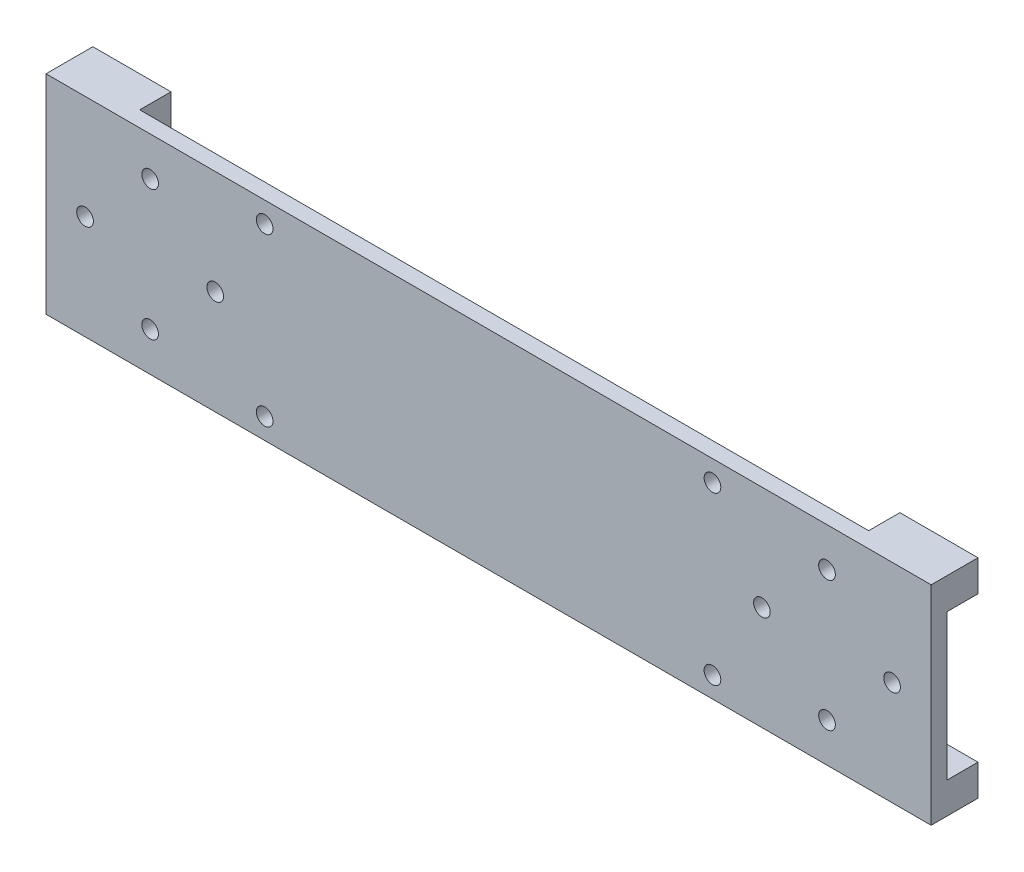
ISO-10303-21;
HEADER;
FILE_DESCRIPTION(('STEP AP214'),'2;1');
FILE_NAME('part.step','',(''),(''),'','','');
FILE_SCHEMA(('AUTOMOTIVE_DESIGN { 1 0 10303 214 1 1 1 1 }'));
ENDSEC;
DATA;
#1=APPLICATION_CONTEXT('core data for automotive mechanical design processes');
#2=APPLICATION_PROTOCOL_DEFINITION('international standard','automotive_design',2000,#1);
#3=PRODUCT_CONTEXT('',#1,'mechanical');
#4=PRODUCT('Part','Part','',(#3));
#5=PRODUCT_RELATED_PRODUCT_CATEGORY('part','',(#4));
#6=PRODUCT_DEFINITION_FORMATION('','',#4);
#7=PRODUCT_DEFINITION_CONTEXT('part definition',#1,'design');
#8=PRODUCT_DEFINITION('design','',#6,#7);
#9=PRODUCT_DEFINITION_SHAPE('','',#8);
#10=(LENGTH_UNIT() NAMED_UNIT(*) SI_UNIT(.MILLI.,.METRE.));
#11=(NAMED_UNIT(*) PLANE_ANGLE_UNIT() SI_UNIT($,.RADIAN.));
#12=(NAMED_UNIT(*) SI_UNIT($,.STERADIAN.) SOLID_ANGLE_UNIT());
#13=UNCERTAINTY_MEASURE_WITH_UNIT(LENGTH_MEASURE(1.E-05),#10,'distance_accuracy_value','');
#14=(GEOMETRIC_REPRESENTATION_CONTEXT(3) GLOBAL_UNCERTAINTY_ASSIGNED_CONTEXT((#13)) GLOBAL_UNIT_ASSIGNED_CONTEXT((#10,
#11,#12)) REPRESENTATION_CONTEXT('',''));
#15=CARTESIAN_POINT('',(0.,0.,0.));
#16=DIRECTION('',(0.,0.,1.));
#17=DIRECTION('',(1.,0.,0.));
#18=AXIS2_PLACEMENT_3D('',#15,#16,#17);
#19=CARTESIAN_POINT('',(0.,0.,0.));
#20=DIRECTION('',(0.,0.,1.));
#21=DIRECTION('',(1.,0.,0.));
#22=AXIS2_PLACEMENT_3D('',#19,#20,#21);
#23=PLANE('',#22);
#24=CARTESIAN_POINT('',(36.4960422163588,-19.9709762532981,0.));
#25=DIRECTION('',(0.,0.,-1.));
#26=DIRECTION('',(-1.,0.,0.));
#27=AXIS2_PLACEMENT_3D('',#24,#25,#26);
#28=CIRCLE('',#27,1.6);
#29=CARTESIAN_POINT('',(34.8960422163588,-19.9709762532981,0.));
#30=VERTEX_POINT('',#29);
#31=EDGE_CURVE('E303',#30,#30,#28,.T.);
#32=ORIENTED_EDGE('',*,*,#31,.F.);
#33=EDGE_LOOP('',(#32));
#34=FACE_BOUND('',#33,.T.);
#35=CARTESIAN_POINT('',(-49.5039577836412,12.0290237467019,0.));
#36=DIRECTION('',(0.,0.,-1.));
#37=DIRECTION('',(-1.,0.,0.));
#38=AXIS2_PLACEMENT_3D('',#35,#36,#37);
#39=CIRCLE('',#38,1.6);
#40=CARTESIAN_POINT('',(-51.1039577836411,12.0290237467019,0.));
#41=VERTEX_POINT('',#40);
#42=EDGE_CURVE('E312',#41,#41,#39,.T.);
#43=ORIENTED_EDGE('',*,*,#42,.F.);
#44=EDGE_LOOP('',(#43));
#45=FACE_BOUND('',#44,.T.);
#46=CARTESIAN_POINT('',(-49.5039577836412,-19.9709762532981,0.));
#47=DIRECTION('',(0.,0.,-1.));
#48=DIRECTION('',(-1.,0.,0.));
#49=AXIS2_PLACEMENT_3D('',#46,#47,#48);
#50=CIRCLE('',#49,1.6);
#51=CARTESIAN_POINT('',(-51.1039577836411,-19.9709762532981,0.));
#52=VERTEX_POINT('',#51);
#53=EDGE_CURVE('E295',#52,#52,#50,.T.);
#54=ORIENTED_EDGE('',*,*,#53,.F.);
#55=EDGE_LOOP('',(#54));
#56=FACE_BOUND('',#55,.T.);
#57=CARTESIAN_POINT('',(36.4960422163588,12.0290237467019,0.));
#58=DIRECTION('',(0.,0.,-1.));
#59=DIRECTION('',(-1.,0.,0.));
#60=AXIS2_PLACEMENT_3D('',#57,#58,#59);
#61=CIRCLE('',#60,1.6);
#62=CARTESIAN_POINT('',(34.8960422163588,12.0290237467019,0.));
#63=VERTEX_POINT('',#62);
#64=EDGE_CURVE('E307',#63,#63,#61,.T.);
#65=ORIENTED_EDGE('',*,*,#64,.F.);
#66=EDGE_LOOP('',(#65));
#67=FACE_BOUND('',#66,.T.);
#68=CARTESIAN_POINT('',(-71.5039577836412,8.52902374670185,0.));
#69=DIRECTION('',(0.,0.,1.));
#70=DIRECTION('',(1.,0.,0.));
#71=AXIS2_PLACEMENT_3D('',#68,#69,#70);
#72=CIRCLE('',#71,1.6);
#73=CARTESIAN_POINT('',(-69.9039577836412,8.52902374670185,0.));
#74=VERTEX_POINT('',#73);
#75=EDGE_CURVE('E379',#74,#74,#72,.T.);
#76=ORIENTED_EDGE('',*,*,#75,.T.);
#77=EDGE_LOOP('',(#76));
#78=FACE_BOUND('',#77,.T.);
#79=CARTESIAN_POINT('',(-59.0039577836412,-3.97097625329815,0.));
#80=DIRECTION('',(0.,0.,1.));
#81=DIRECTION('',(1.,0.,0.));
#82=AXIS2_PLACEMENT_3D('',#79,#80,#81);
#83=CIRCLE('',#82,1.6);
#84=CARTESIAN_POINT('',(-57.4039577836412,-3.97097625329815,0.));
#85=VERTEX_POINT('',#84);
#86=EDGE_CURVE('E371',#85,#85,#83,.T.);
#87=ORIENTED_EDGE('',*,*,#86,.T.);
#88=EDGE_LOOP('',(#87));
#89=FACE_BOUND('',#88,.T.);
#90=CARTESIAN_POINT('',(-71.5039577836412,-16.4709762532982,0.));
#91=DIRECTION('',(0.,0.,1.));
#92=DIRECTION('',(1.,0.,0.));
#93=AXIS2_PLACEMENT_3D('',#90,#91,#92);
#94=CIRCLE('',#93,1.6);
#95=CARTESIAN_POINT('',(-69.9039577836412,-16.4709762532982,0.));
#96=VERTEX_POINT('',#95);
#97=EDGE_CURVE('E363',#96,#96,#94,.T.);
#98=ORIENTED_EDGE('',*,*,#97,.T.);
#99=EDGE_LOOP('',(#98));
#100=FACE_BOUND('',#99,.T.);
#101=CARTESIAN_POINT('',(-84.0039577836412,-3.97097625329815,0.));
#102=DIRECTION('',(0.,0.,1.));
#103=DIRECTION('',(1.,0.,0.));
#104=AXIS2_PLACEMENT_3D('',#101,#102,#103);
#105=CIRCLE('',#104,1.60000000000001);
#106=CARTESIAN_POINT('',(-82.4039577836411,-3.97097625329815,0.));
#107=VERTEX_POINT('',#106);
#108=EDGE_CURVE('E355',#107,#107,#105,.T.);
#109=ORIENTED_EDGE('',*,*,#108,.T.);
#110=EDGE_LOOP('',(#109));
#111=FACE_BOUND('',#110,.T.);
#112=CARTESIAN_POINT('',(70.9960422163588,-3.97097625329815,0.));
#113=DIRECTION('',(0.,0.,1.));
#114=DIRECTION('',(-1.,0.,0.));
#115=AXIS2_PLACEMENT_3D('',#112,#113,#114);
#116=CIRCLE('',#115,1.60000000000001);
#117=CARTESIAN_POINT('',(69.3960422163588,-3.97097625329815,0.));
#118=VERTEX_POINT('',#117);
#119=EDGE_CURVE('E347',#118,#118,#116,.T.);
#120=ORIENTED_EDGE('',*,*,#119,.T.);
#121=EDGE_LOOP('',(#120));
#122=FACE_BOUND('',#121,.T.);
#123=CARTESIAN_POINT('',(58.4960422163588,8.52902374670185,0.));
#124=DIRECTION('',(0.,0.,1.));
#125=DIRECTION('',(-1.,0.,0.));
#126=AXIS2_PLACEMENT_3D('',#123,#124,#125);
#127=CIRCLE('',#126,1.6);
#128=CARTESIAN_POINT('',(56.8960422163588,8.52902374670185,0.));
#129=VERTEX_POINT('',#128);
#130=EDGE_CURVE('E339',#129,#129,#127,.T.);
#131=ORIENTED_EDGE('',*,*,#130,.T.);
#132=EDGE_LOOP('',(#131));
#133=FACE_BOUND('',#132,.T.);
#134=CARTESIAN_POINT('',(58.4960422163588,-16.4709762532982,0.));
#135=DIRECTION('',(0.,0.,1.));
#136=DIRECTION('',(-1.,0.,0.));
#137=AXIS2_PLACEMENT_3D('',#134,#135,#136);
#138=CIRCLE('',#137,1.6);
#139=CARTESIAN_POINT('',(56.8960422163588,-16.4709762532982,0.));
#140=VERTEX_POINT('',#139);
#141=EDGE_CURVE('E331',#140,#140,#138,.T.);
#142=ORIENTED_EDGE('',*,*,#141,.T.);
#143=EDGE_LOOP('',(#142));
#144=FACE_BOUND('',#143,.T.);
#145=CARTESIAN_POINT('',(45.9960422163588,-3.97097625329815,0.));
#146=DIRECTION('',(0.,0.,1.));
#147=DIRECTION('',(-1.,0.,0.));
#148=AXIS2_PLACEMENT_3D('',#145,#146,#147);
#149=CIRCLE('',#148,1.6);
#150=CARTESIAN_POINT('',(44.3960422163588,-3.97097625329815,0.));
#151=VERTEX_POINT('',#150);
#152=EDGE_CURVE('E323',#151,#151,#149,.T.);
#153=ORIENTED_EDGE('',*,*,#152,.T.);
#154=EDGE_LOOP('',(#153));
#155=FACE_BOUND('',#154,.T.);
#156=DIRECTION('',(1.,0.,0.));
#157=VECTOR('',#156,1.);
#158=CARTESIAN_POINT('',(78.4960422163588,-17.9709762532982,0.));
#159=LINE('',#158,#157);
#160=CARTESIAN_POINT('',(63.4960422163589,-17.9709762532982,0.));
#161=VERTEX_POINT('',#160);
#162=CARTESIAN_POINT('',(78.4960422163588,-17.9709762532982,0.));
#163=VERTEX_POINT('',#162);
#164=EDGE_CURVE('E211',#161,#163,#159,.T.);
#165=ORIENTED_EDGE('',*,*,#164,.F.);
#166=DIRECTION('',(0.,1.,0.));
#167=VECTOR('',#166,1.);
#168=CARTESIAN_POINT('',(63.4960422163589,-23.9709762532982,0.));
#169=LINE('',#168,#167);
#170=CARTESIAN_POINT('',(63.4960422163589,-23.9709762532982,0.));
#171=VERTEX_POINT('',#170);
#172=EDGE_CURVE('E61',#171,#161,#169,.T.);
#173=ORIENTED_EDGE('',*,*,#172,.F.);
#174=DIRECTION('',(1.,0.,0.));
#175=VECTOR('',#174,1.);
#176=CARTESIAN_POINT('',(-91.5039577836412,-23.9709762532982,0.));
#177=LINE('',#176,#175);
#178=CARTESIAN_POINT('',(-76.5039577836412,-23.9709762532982,0.));
#179=VERTEX_POINT('',#178);
#180=EDGE_CURVE('E65',#179,#171,#177,.T.);
#181=ORIENTED_EDGE('',*,*,#180,.F.);
#182=DIRECTION('',(0.,-1.,0.));
#183=VECTOR('',#182,1.);
#184=CARTESIAN_POINT('',(-76.5039577836412,-23.9709762532981,0.));
#185=LINE('',#184,#183);
#186=CARTESIAN_POINT('',(-76.5039577836412,-17.9709762532981,0.));
#187=VERTEX_POINT('',#186);
#188=EDGE_CURVE('E153',#187,#179,#185,.T.);
#189=ORIENTED_EDGE('',*,*,#188,.F.);
#190=DIRECTION('',(1.,0.,0.));
#191=VECTOR('',#190,1.);
#192=CARTESIAN_POINT('',(-91.5039577836412,-17.9709762532981,0.));
#193=LINE('',#192,#191);
#194=CARTESIAN_POINT('',(-91.5039577836412,-17.9709762532981,0.));
#195=VERTEX_POINT('',#194);
#196=EDGE_CURVE('E155',#195,#187,#193,.T.);
#197=ORIENTED_EDGE('',*,*,#196,.F.);
#198=DIRECTION('',(0.,-1.,0.));
#199=VECTOR('',#198,1.);
#200=CARTESIAN_POINT('',(-91.5039577836412,16.0290237467018,0.));
#201=LINE('',#200,#199);
#202=CARTESIAN_POINT('',(-91.5039577836412,10.0290237467019,0.));
#203=VERTEX_POINT('',#202);
#204=EDGE_CURVE('E387',#203,#195,#201,.T.);
#205=ORIENTED_EDGE('',*,*,#204,.F.);
#206=DIRECTION('',(-1.,0.,0.));
#207=VECTOR('',#206,1.);
#208=CARTESIAN_POINT('',(-91.5039577836412,10.0290237467019,0.));
#209=LINE('',#208,#207);
#210=CARTESIAN_POINT('',(-76.5039577836412,10.0290237467019,0.));
#211=VERTEX_POINT('',#210);
#212=EDGE_CURVE('E242',#211,#203,#209,.T.);
#213=ORIENTED_EDGE('',*,*,#212,.F.);
#214=DIRECTION('',(0.,-1.,0.));
#215=VECTOR('',#214,1.);
#216=CARTESIAN_POINT('',(-76.5039577836412,16.0290237467019,0.));
#217=LINE('',#216,#215);
#218=CARTESIAN_POINT('',(-76.5039577836412,16.0290237467018,0.));
#219=VERTEX_POINT('',#218);
#220=EDGE_CURVE('E202',#219,#211,#217,.T.);
#221=ORIENTED_EDGE('',*,*,#220,.F.);
#222=DIRECTION('',(-1.,0.,0.));
#223=VECTOR('',#222,1.);
#224=CARTESIAN_POINT('',(-91.5039577836412,16.0290237467018,0.));
#225=LINE('',#224,#223);
#226=CARTESIAN_POINT('',(63.4960422163589,16.0290237467018,0.));
#227=VERTEX_POINT('',#226);
#228=EDGE_CURVE('E396',#227,#219,#225,.T.);
#229=ORIENTED_EDGE('',*,*,#228,.F.);
#230=DIRECTION('',(0.,1.,0.));
#231=VECTOR('',#230,1.);
#232=CARTESIAN_POINT('',(63.4960422163589,16.0290237467018,0.));
#233=LINE('',#232,#231);
#234=CARTESIAN_POINT('',(63.4960422163589,10.0290237467018,0.));
#235=VERTEX_POINT('',#234);
#236=EDGE_CURVE('E266',#235,#227,#233,.T.);
#237=ORIENTED_EDGE('',*,*,#236,.F.);
#238=DIRECTION('',(-1.,0.,0.));
#239=VECTOR('',#238,1.);
#240=CARTESIAN_POINT('',(78.4960422163588,10.0290237467018,0.));
#241=LINE('',#240,#239);
#242=CARTESIAN_POINT('',(78.4960422163588,10.0290237467018,0.));
#243=VERTEX_POINT('',#242);
#244=EDGE_CURVE('E218',#243,#235,#241,.T.);
#245=ORIENTED_EDGE('',*,*,#244,.F.);
#246=DIRECTION('',(0.,1.,0.));
#247=VECTOR('',#246,1.);
#248=CARTESIAN_POINT('',(78.4960422163588,16.0290237467018,0.));
#249=LINE('',#248,#247);
#250=EDGE_CURVE('E410',#163,#243,#249,.T.);
#251=ORIENTED_EDGE('',*,*,#250,.F.);
#252=EDGE_LOOP('',(#165,#173,#181,#189,#197,#205,#213,#221,#229,#237,#245,#251));
#253=FACE_BOUND('',#252,.T.);
#254=ADVANCED_FACE('F45',(#34,#45,#56,#67,#78,#89,#100,#111,#122,#133,#144,#155,#253),#23,.F.);
#255=CARTESIAN_POINT('',(0.,0.,3.));
#256=DIRECTION('',(0.,0.,1.));
#257=DIRECTION('',(1.,0.,0.));
#258=AXIS2_PLACEMENT_3D('',#255,#256,#257);
#259=PLANE('',#258);
#260=CARTESIAN_POINT('',(36.4960422163588,-19.9709762532981,3.));
#261=DIRECTION('',(0.,0.,-1.));
#262=DIRECTION('',(-1.,0.,0.));
#263=AXIS2_PLACEMENT_3D('',#260,#261,#262);
#264=CIRCLE('',#263,1.6);
#265=CARTESIAN_POINT('',(34.8960422163588,-19.9709762532981,3.));
#266=VERTEX_POINT('',#265);
#267=EDGE_CURVE('E308',#266,#266,#264,.T.);
#268=ORIENTED_EDGE('',*,*,#267,.T.);
#269=EDGE_LOOP('',(#268));
#270=FACE_BOUND('',#269,.T.);
#271=CARTESIAN_POINT('',(-49.5039577836412,12.0290237467019,3.));
#272=DIRECTION('',(0.,0.,-1.));
#273=DIRECTION('',(-1.,0.,0.));
#274=AXIS2_PLACEMENT_3D('',#271,#272,#273);
#275=CIRCLE('',#274,1.6);
#276=CARTESIAN_POINT('',(-51.1039577836411,12.0290237467019,3.));
#277=VERTEX_POINT('',#276);
#278=EDGE_CURVE('E299',#277,#277,#275,.T.);
#279=ORIENTED_EDGE('',*,*,#278,.T.);
#280=EDGE_LOOP('',(#279));
#281=FACE_BOUND('',#280,.T.);
#282=CARTESIAN_POINT('',(-49.5039577836412,-19.9709762532981,3.));
#283=DIRECTION('',(0.,0.,-1.));
#284=DIRECTION('',(-1.,0.,0.));
#285=AXIS2_PLACEMENT_3D('',#282,#283,#284);
#286=CIRCLE('',#285,1.6);
#287=CARTESIAN_POINT('',(-51.1039577836411,-19.9709762532981,3.));
#288=VERTEX_POINT('',#287);
#289=EDGE_CURVE('E294',#288,#288,#286,.T.);
#290=ORIENTED_EDGE('',*,*,#289,.T.);
#291=EDGE_LOOP('',(#290));
#292=FACE_BOUND('',#291,.T.);
#293=CARTESIAN_POINT('',(36.4960422163588,12.0290237467019,3.));
#294=DIRECTION('',(0.,0.,-1.));
#295=DIRECTION('',(-1.,0.,0.));
#296=AXIS2_PLACEMENT_3D('',#293,#294,#295);
#297=CIRCLE('',#296,1.6);
#298=CARTESIAN_POINT('',(34.8960422163588,12.0290237467019,3.));
#299=VERTEX_POINT('',#298);
#300=EDGE_CURVE('E319',#299,#299,#297,.T.);
#301=ORIENTED_EDGE('',*,*,#300,.T.);
#302=EDGE_LOOP('',(#301));
#303=FACE_BOUND('',#302,.T.);
#304=CARTESIAN_POINT('',(58.4960422163588,-16.4709762532982,3.));
#305=DIRECTION('',(0.,0.,1.));
#306=DIRECTION('',(-1.,0.,0.));
#307=AXIS2_PLACEMENT_3D('',#304,#305,#306);
#308=CIRCLE('',#307,1.6);
#309=CARTESIAN_POINT('',(56.8960422163588,-16.4709762532982,3.));
#310=VERTEX_POINT('',#309);
#311=EDGE_CURVE('E335',#310,#310,#308,.T.);
#312=ORIENTED_EDGE('',*,*,#311,.F.);
#313=EDGE_LOOP('',(#312));
#314=FACE_BOUND('',#313,.T.);
#315=CARTESIAN_POINT('',(70.9960422163588,-3.97097625329815,3.));
#316=DIRECTION('',(0.,0.,1.));
#317=DIRECTION('',(-1.,0.,0.));
#318=AXIS2_PLACEMENT_3D('',#315,#316,#317);
#319=CIRCLE('',#318,1.60000000000001);
#320=CARTESIAN_POINT('',(69.3960422163588,-3.97097625329815,3.));
#321=VERTEX_POINT('',#320);
#322=EDGE_CURVE('E351',#321,#321,#319,.T.);
#323=ORIENTED_EDGE('',*,*,#322,.F.);
#324=EDGE_LOOP('',(#323));
#325=FACE_BOUND('',#324,.T.);
#326=CARTESIAN_POINT('',(-71.5039577836412,-16.4709762532982,3.));
#327=DIRECTION('',(0.,0.,1.));
#328=DIRECTION('',(1.,0.,0.));
#329=AXIS2_PLACEMENT_3D('',#326,#327,#328);
#330=CIRCLE('',#329,1.6);
#331=CARTESIAN_POINT('',(-69.9039577836412,-16.4709762532982,3.));
#332=VERTEX_POINT('',#331);
#333=EDGE_CURVE('E367',#332,#332,#330,.T.);
#334=ORIENTED_EDGE('',*,*,#333,.F.);
#335=EDGE_LOOP('',(#334));
#336=FACE_BOUND('',#335,.T.);
#337=CARTESIAN_POINT('',(-71.5039577836412,8.52902374670185,3.));
#338=DIRECTION('',(0.,0.,1.));
#339=DIRECTION('',(1.,0.,0.));
#340=AXIS2_PLACEMENT_3D('',#337,#338,#339);
#341=CIRCLE('',#340,1.6);
#342=CARTESIAN_POINT('',(-69.9039577836412,8.52902374670185,3.));
#343=VERTEX_POINT('',#342);
#344=EDGE_CURVE('E383',#343,#343,#341,.T.);
#345=ORIENTED_EDGE('',*,*,#344,.F.);
#346=EDGE_LOOP('',(#345));
#347=FACE_BOUND('',#346,.T.);
#348=DIRECTION('',(0.,-1.,0.));
#349=VECTOR('',#348,1.);
#350=CARTESIAN_POINT('',(-91.5039577836412,16.0290237467018,3.));
#351=LINE('',#350,#349);
#352=CARTESIAN_POINT('',(-91.5039577836412,16.0290237467018,3.));
#353=VERTEX_POINT('',#352);
#354=CARTESIAN_POINT('',(-91.5039577836412,-23.9709762532982,3.));
#355=VERTEX_POINT('',#354);
#356=EDGE_CURVE('E391',#353,#355,#351,.T.);
#357=ORIENTED_EDGE('',*,*,#356,.T.);
#358=DIRECTION('',(1.,0.,0.));
#359=VECTOR('',#358,1.);
#360=CARTESIAN_POINT('',(-91.5039577836412,-23.9709762532982,3.));
#361=LINE('',#360,#359);
#362=CARTESIAN_POINT('',(78.4960422163588,-23.9709762532982,3.));
#363=VERTEX_POINT('',#362);
#364=EDGE_CURVE('E395',#355,#363,#361,.T.);
#365=ORIENTED_EDGE('',*,*,#364,.T.);
#366=DIRECTION('',(0.,1.,0.));
#367=VECTOR('',#366,1.);
#368=CARTESIAN_POINT('',(78.4960422163588,16.0290237467018,3.));
#369=LINE('',#368,#367);
#370=CARTESIAN_POINT('',(78.4960422163588,16.0290237467018,3.));
#371=VERTEX_POINT('',#370);
#372=EDGE_CURVE('E399',#363,#371,#369,.T.);
#373=ORIENTED_EDGE('',*,*,#372,.T.);
#374=DIRECTION('',(-1.,0.,0.));
#375=VECTOR('',#374,1.);
#376=CARTESIAN_POINT('',(-91.5039577836412,16.0290237467018,3.));
#377=LINE('',#376,#375);
#378=EDGE_CURVE('E402',#371,#353,#377,.T.);
#379=ORIENTED_EDGE('',*,*,#378,.T.);
#380=EDGE_LOOP('',(#357,#365,#373,#379));
#381=FACE_BOUND('',#380,.T.);
#382=CARTESIAN_POINT('',(-59.0039577836412,-3.97097625329815,3.));
#383=DIRECTION('',(0.,0.,1.));
#384=DIRECTION('',(1.,0.,0.));
#385=AXIS2_PLACEMENT_3D('',#382,#383,#384);
#386=CIRCLE('',#385,1.6);
#387=CARTESIAN_POINT('',(-57.4039577836412,-3.97097625329815,3.));
#388=VERTEX_POINT('',#387);
#389=EDGE_CURVE('E375',#388,#388,#386,.T.);
#390=ORIENTED_EDGE('',*,*,#389,.F.);
#391=EDGE_LOOP('',(#390));
#392=FACE_BOUND('',#391,.T.);
#393=CARTESIAN_POINT('',(-84.0039577836412,-3.97097625329815,3.));
#394=DIRECTION('',(0.,0.,1.));
#395=DIRECTION('',(1.,0.,0.));
#396=AXIS2_PLACEMENT_3D('',#393,#394,#395);
#397=CIRCLE('',#396,1.60000000000001);
#398=CARTESIAN_POINT('',(-82.4039577836411,-3.97097625329815,3.));
#399=VERTEX_POINT('',#398);
#400=EDGE_CURVE('E359',#399,#399,#397,.T.);
#401=ORIENTED_EDGE('',*,*,#400,.F.);
#402=EDGE_LOOP('',(#401));
#403=FACE_BOUND('',#402,.T.);
#404=CARTESIAN_POINT('',(58.4960422163588,8.52902374670185,3.));
#405=DIRECTION('',(0.,0.,1.));
#406=DIRECTION('',(-1.,0.,0.));
#407=AXIS2_PLACEMENT_3D('',#404,#405,#406);
#408=CIRCLE('',#407,1.6);
#409=CARTESIAN_POINT('',(56.8960422163588,8.52902374670185,3.));
#410=VERTEX_POINT('',#409);
#411=EDGE_CURVE('E343',#410,#410,#408,.T.);
#412=ORIENTED_EDGE('',*,*,#411,.F.);
#413=EDGE_LOOP('',(#412));
#414=FACE_BOUND('',#413,.T.);
#415=CARTESIAN_POINT('',(45.9960422163588,-3.97097625329815,3.));
#416=DIRECTION('',(0.,0.,1.));
#417=DIRECTION('',(-1.,0.,0.));
#418=AXIS2_PLACEMENT_3D('',#415,#416,#417);
#419=CIRCLE('',#418,1.6);
#420=CARTESIAN_POINT('',(44.3960422163588,-3.97097625329815,3.));
#421=VERTEX_POINT('',#420);
#422=EDGE_CURVE('E327',#421,#421,#419,.T.);
#423=ORIENTED_EDGE('',*,*,#422,.F.);
#424=EDGE_LOOP('',(#423));
#425=FACE_BOUND('',#424,.T.);
#426=ADVANCED_FACE('F456',(#270,#281,#292,#303,#314,#325,#336,#347,#381,#392,#403,#414,#425),
#259,.T.);
#427=CARTESIAN_POINT('',(-91.5039577836412,16.0290237467018,3.));
#428=DIRECTION('',(1.,0.,0.));
#429=DIRECTION('',(0.,0.,-1.));
#430=AXIS2_PLACEMENT_3D('',#427,#428,#429);
#431=PLANE('',#430);
#432=DIRECTION('',(0.,0.,-1.));
#433=VECTOR('',#432,1.);
#434=CARTESIAN_POINT('',(-91.5039577836412,16.0290237467018,3.));
#435=LINE('',#434,#433);
#436=CARTESIAN_POINT('',(-91.5039577836412,16.0290237467019,-6.));
#437=VERTEX_POINT('',#436);
#438=EDGE_CURVE('E405',#353,#437,#435,.T.);
#439=ORIENTED_EDGE('',*,*,#438,.T.);
#440=DIRECTION('',(0.,1.,0.));
#441=VECTOR('',#440,1.);
#442=CARTESIAN_POINT('',(-91.5039577836412,16.0290237467019,-6.));
#443=LINE('',#442,#441);
#444=CARTESIAN_POINT('',(-91.5039577836412,10.0290237467019,-6.));
#445=VERTEX_POINT('',#444);
#446=EDGE_CURVE('E246',#445,#437,#443,.T.);
#447=ORIENTED_EDGE('',*,*,#446,.F.);
#448=DIRECTION('',(0.,0.,1.));
#449=VECTOR('',#448,1.);
#450=CARTESIAN_POINT('',(-91.5039577836412,10.0290237467019,-6.));
#451=LINE('',#450,#449);
#452=EDGE_CURVE('E237',#445,#203,#451,.T.);
#453=ORIENTED_EDGE('',*,*,#452,.T.);
#454=ORIENTED_EDGE('',*,*,#204,.T.);
#455=DIRECTION('',(0.,0.,1.));
#456=VECTOR('',#455,1.);
#457=CARTESIAN_POINT('',(-91.5039577836412,-17.9709762532981,-6.));
#458=LINE('',#457,#456);
#459=CARTESIAN_POINT('',(-91.5039577836412,-17.9709762532981,-6.));
#460=VERTEX_POINT('',#459);
#461=EDGE_CURVE('E172',#460,#195,#458,.T.);
#462=ORIENTED_EDGE('',*,*,#461,.F.);
#463=DIRECTION('',(0.,1.,0.));
#464=VECTOR('',#463,1.);
#465=CARTESIAN_POINT('',(-91.5039577836412,-23.9709762532981,-6.));
#466=LINE('',#465,#464);
#467=CARTESIAN_POINT('',(-91.5039577836412,-23.9709762532981,-6.));
#468=VERTEX_POINT('',#467);
#469=EDGE_CURVE('E191',#468,#460,#466,.T.);
#470=ORIENTED_EDGE('',*,*,#469,.F.);
#471=DIRECTION('',(0.,0.,-1.));
#472=VECTOR('',#471,1.);
#473=CARTESIAN_POINT('',(-91.5039577836412,-23.9709762532982,3.));
#474=LINE('',#473,#472);
#475=EDGE_CURVE('E11',#355,#468,#474,.T.);
#476=ORIENTED_EDGE('',*,*,#475,.F.);
#477=ORIENTED_EDGE('',*,*,#356,.F.);
#478=EDGE_LOOP('',(#439,#447,#453,#454,#462,#470,#476,#477));
#479=FACE_BOUND('',#478,.T.);
#480=ADVANCED_FACE('F47',(#479),#431,.F.);
#481=CARTESIAN_POINT('',(-91.5039577836412,-23.9709762532982,3.));
#482=DIRECTION('',(0.,1.,0.));
#483=DIRECTION('',(0.,0.,1.));
#484=AXIS2_PLACEMENT_3D('',#481,#482,#483);
#485=PLANE('',#484);
#486=ORIENTED_EDGE('',*,*,#475,.T.);
#487=DIRECTION('',(-1.,0.,0.));
#488=VECTOR('',#487,1.);
#489=CARTESIAN_POINT('',(-91.5039577836412,-23.9709762532981,-6.));
#490=LINE('',#489,#488);
#491=CARTESIAN_POINT('',(-76.5039577836412,-23.9709762532981,-6.));
#492=VERTEX_POINT('',#491);
#493=EDGE_CURVE('E162',#492,#468,#490,.T.);
#494=ORIENTED_EDGE('',*,*,#493,.F.);
#495=DIRECTION('',(0.,0.,1.));
#496=VECTOR('',#495,1.);
#497=CARTESIAN_POINT('',(-76.5039577836412,-23.9709762532981,-6.));
#498=LINE('',#497,#496);
#499=EDGE_CURVE('E179',#492,#179,#498,.T.);
#500=ORIENTED_EDGE('',*,*,#499,.T.);
#501=ORIENTED_EDGE('',*,*,#180,.T.);
#502=DIRECTION('',(0.,0.,1.));
#503=VECTOR('',#502,1.);
#504=CARTESIAN_POINT('',(63.4960422163589,-23.9709762532982,-6.));
#505=LINE('',#504,#503);
#506=CARTESIAN_POINT('',(63.4960422163589,-23.9709762532982,-6.));
#507=VERTEX_POINT('',#506);
#508=EDGE_CURVE('E197',#507,#171,#505,.T.);
#509=ORIENTED_EDGE('',*,*,#508,.F.);
#510=DIRECTION('',(-1.,0.,0.));
#511=VECTOR('',#510,1.);
#512=CARTESIAN_POINT('',(78.4960422163588,-23.9709762532982,-6.));
#513=LINE('',#512,#511);
#514=CARTESIAN_POINT('',(78.4960422163588,-23.9709762532982,-6.));
#515=VERTEX_POINT('',#514);
#516=EDGE_CURVE('E224',#515,#507,#513,.T.);
#517=ORIENTED_EDGE('',*,*,#516,.F.);
#518=DIRECTION('',(0.,0.,-1.));
#519=VECTOR('',#518,1.);
#520=CARTESIAN_POINT('',(78.4960422163588,-23.9709762532982,3.));
#521=LINE('',#520,#519);
#522=EDGE_CURVE('E54',#363,#515,#521,.T.);
#523=ORIENTED_EDGE('',*,*,#522,.F.);
#524=ORIENTED_EDGE('',*,*,#364,.F.);
#525=EDGE_LOOP('',(#486,#494,#500,#501,#509,#517,#523,#524));
#526=FACE_BOUND('',#525,.T.);
#527=ADVANCED_FACE('F431',(#526),#485,.F.);
#528=CARTESIAN_POINT('',(78.4960422163588,16.0290237467018,3.));
#529=DIRECTION('',(-1.,0.,0.));
#530=DIRECTION('',(0.,-1.,0.));
#531=AXIS2_PLACEMENT_3D('',#528,#529,#530);
#532=PLANE('',#531);
#533=ORIENTED_EDGE('',*,*,#522,.T.);
#534=DIRECTION('',(0.,-1.,0.));
#535=VECTOR('',#534,1.);
#536=CARTESIAN_POINT('',(78.4960422163588,-23.9709762532982,-6.));
#537=LINE('',#536,#535);
#538=CARTESIAN_POINT('',(78.4960422163588,-17.9709762532982,-6.));
#539=VERTEX_POINT('',#538);
#540=EDGE_CURVE('E215',#539,#515,#537,.T.);
#541=ORIENTED_EDGE('',*,*,#540,.F.);
#542=DIRECTION('',(0.,0.,1.));
#543=VECTOR('',#542,1.);
#544=CARTESIAN_POINT('',(78.4960422163588,-17.9709762532982,-6.));
#545=LINE('',#544,#543);
#546=EDGE_CURVE('E206',#539,#163,#545,.T.);
#547=ORIENTED_EDGE('',*,*,#546,.T.);
#548=ORIENTED_EDGE('',*,*,#250,.T.);
#549=DIRECTION('',(0.,0.,1.));
#550=VECTOR('',#549,1.);
#551=CARTESIAN_POINT('',(78.4960422163588,10.0290237467018,-6.));
#552=LINE('',#551,#550);
#553=CARTESIAN_POINT('',(78.4960422163588,10.0290237467018,-6.));
#554=VERTEX_POINT('',#553);
#555=EDGE_CURVE('E290',#554,#243,#552,.T.);
#556=ORIENTED_EDGE('',*,*,#555,.F.);
#557=DIRECTION('',(0.,-1.,0.));
#558=VECTOR('',#557,1.);
#559=CARTESIAN_POINT('',(78.4960422163588,16.0290237467018,-6.));
#560=LINE('',#559,#558);
#561=CARTESIAN_POINT('',(78.4960422163588,16.0290237467018,-6.));
#562=VERTEX_POINT('',#561);
#563=EDGE_CURVE('E261',#562,#554,#560,.T.);
#564=ORIENTED_EDGE('',*,*,#563,.F.);
#565=DIRECTION('',(0.,0.,-1.));
#566=VECTOR('',#565,1.);
#567=CARTESIAN_POINT('',(78.4960422163588,16.0290237467018,3.));
#568=LINE('',#567,#566);
#569=EDGE_CURVE('E419',#371,#562,#568,.T.);
#570=ORIENTED_EDGE('',*,*,#569,.F.);
#571=ORIENTED_EDGE('',*,*,#372,.F.);
#572=EDGE_LOOP('',(#533,#541,#547,#548,#556,#564,#570,#571));
#573=FACE_BOUND('',#572,.T.);
#574=ADVANCED_FACE('F427',(#573),#532,.F.);
#575=CARTESIAN_POINT('',(-91.5039577836412,16.0290237467018,3.));
#576=DIRECTION('',(0.,-1.,0.));
#577=DIRECTION('',(0.,0.,-1.));
#578=AXIS2_PLACEMENT_3D('',#575,#576,#577);
#579=PLANE('',#578);
#580=ORIENTED_EDGE('',*,*,#569,.T.);
#581=DIRECTION('',(1.,0.,0.));
#582=VECTOR('',#581,1.);
#583=CARTESIAN_POINT('',(78.4960422163588,16.0290237467018,-6.));
#584=LINE('',#583,#582);
#585=CARTESIAN_POINT('',(63.4960422163589,16.0290237467018,-6.));
#586=VERTEX_POINT('',#585);
#587=EDGE_CURVE('E272',#586,#562,#584,.T.);
#588=ORIENTED_EDGE('',*,*,#587,.F.);
#589=DIRECTION('',(0.,0.,1.));
#590=VECTOR('',#589,1.);
#591=CARTESIAN_POINT('',(63.4960422163589,16.0290237467018,-6.));
#592=LINE('',#591,#590);
#593=EDGE_CURVE('E276',#586,#227,#592,.T.);
#594=ORIENTED_EDGE('',*,*,#593,.T.);
#595=ORIENTED_EDGE('',*,*,#228,.T.);
#596=DIRECTION('',(0.,0.,1.));
#597=VECTOR('',#596,1.);
#598=CARTESIAN_POINT('',(-76.5039577836412,16.0290237467019,-6.));
#599=LINE('',#598,#597);
#600=CARTESIAN_POINT('',(-76.5039577836412,16.0290237467019,-6.));
#601=VERTEX_POINT('',#600);
#602=EDGE_CURVE('E174',#601,#219,#599,.T.);
#603=ORIENTED_EDGE('',*,*,#602,.F.);
#604=DIRECTION('',(1.,0.,0.));
#605=VECTOR('',#604,1.);
#606=CARTESIAN_POINT('',(-91.5039577836412,16.0290237467019,-6.));
#607=LINE('',#606,#605);
#608=EDGE_CURVE('E255',#437,#601,#607,.T.);
#609=ORIENTED_EDGE('',*,*,#608,.F.);
#610=ORIENTED_EDGE('',*,*,#438,.F.);
#611=ORIENTED_EDGE('',*,*,#378,.F.);
#612=EDGE_LOOP('',(#580,#588,#594,#595,#603,#609,#610,#611));
#613=FACE_BOUND('',#612,.T.);
#614=ADVANCED_FACE('F452',(#613),#579,.F.);
#615=CARTESIAN_POINT('',(-71.5039577836412,8.52902374670185,3.));
#616=DIRECTION('',(0.,0.,-1.));
#617=DIRECTION('',(-1.,0.,0.));
#618=AXIS2_PLACEMENT_3D('',#615,#616,#617);
#619=CYLINDRICAL_SURFACE('',#618,1.6);
#620=ORIENTED_EDGE('',*,*,#344,.T.);
#621=EDGE_LOOP('',(#620));
#622=FACE_BOUND('',#621,.T.);
#623=ORIENTED_EDGE('',*,*,#75,.F.);
#624=EDGE_LOOP('',(#623));
#625=FACE_BOUND('',#624,.T.);
#626=ADVANCED_FACE('F494',(#622,#625),#619,.F.);
#627=CARTESIAN_POINT('',(-59.0039577836412,-3.97097625329815,3.));
#628=DIRECTION('',(0.,0.,-1.));
#629=DIRECTION('',(-1.,0.,0.));
#630=AXIS2_PLACEMENT_3D('',#627,#628,#629);
#631=CYLINDRICAL_SURFACE('',#630,1.6);
#632=ORIENTED_EDGE('',*,*,#389,.T.);
#633=EDGE_LOOP('',(#632));
#634=FACE_BOUND('',#633,.T.);
#635=ORIENTED_EDGE('',*,*,#86,.F.);
#636=EDGE_LOOP('',(#635));
#637=FACE_BOUND('',#636,.T.);
#638=ADVANCED_FACE('F671',(#634,#637),#631,.F.);
#639=CARTESIAN_POINT('',(-71.5039577836412,-16.4709762532982,3.));
#640=DIRECTION('',(0.,0.,-1.));
#641=DIRECTION('',(-1.,0.,0.));
#642=AXIS2_PLACEMENT_3D('',#639,#640,#641);
#643=CYLINDRICAL_SURFACE('',#642,1.6);
#644=ORIENTED_EDGE('',*,*,#333,.T.);
#645=EDGE_LOOP('',(#644));
#646=FACE_BOUND('',#645,.T.);
#647=ORIENTED_EDGE('',*,*,#97,.F.);
#648=EDGE_LOOP('',(#647));
#649=FACE_BOUND('',#648,.T.);
#650=ADVANCED_FACE('F667',(#646,#649),#643,.F.);
#651=CARTESIAN_POINT('',(-84.0039577836412,-3.97097625329815,3.));
#652=DIRECTION('',(0.,0.,-1.));
#653=DIRECTION('',(-1.,0.,0.));
#654=AXIS2_PLACEMENT_3D('',#651,#652,#653);
#655=CYLINDRICAL_SURFACE('',#654,1.60000000000001);
#656=ORIENTED_EDGE('',*,*,#400,.T.);
#657=EDGE_LOOP('',(#656));
#658=FACE_BOUND('',#657,.T.);
#659=ORIENTED_EDGE('',*,*,#108,.F.);
#660=EDGE_LOOP('',(#659));
#661=FACE_BOUND('',#660,.T.);
#662=ADVANCED_FACE('F663',(#658,#661),#655,.F.);
#663=CARTESIAN_POINT('',(70.9960422163588,-3.97097625329815,3.));
#664=DIRECTION('',(0.,0.,-1.));
#665=DIRECTION('',(-1.,0.,0.));
#666=AXIS2_PLACEMENT_3D('',#663,#664,#665);
#667=CYLINDRICAL_SURFACE('',#666,1.60000000000001);
#668=ORIENTED_EDGE('',*,*,#322,.T.);
#669=EDGE_LOOP('',(#668));
#670=FACE_BOUND('',#669,.T.);
#671=ORIENTED_EDGE('',*,*,#119,.F.);
#672=EDGE_LOOP('',(#671));
#673=FACE_BOUND('',#672,.T.);
#674=ADVANCED_FACE('F659',(#670,#673),#667,.F.);
#675=CARTESIAN_POINT('',(58.4960422163588,8.52902374670185,3.));
#676=DIRECTION('',(0.,0.,-1.));
#677=DIRECTION('',(-1.,0.,0.));
#678=AXIS2_PLACEMENT_3D('',#675,#676,#677);
#679=CYLINDRICAL_SURFACE('',#678,1.6);
#680=ORIENTED_EDGE('',*,*,#411,.T.);
#681=EDGE_LOOP('',(#680));
#682=FACE_BOUND('',#681,.T.);
#683=ORIENTED_EDGE('',*,*,#130,.F.);
#684=EDGE_LOOP('',(#683));
#685=FACE_BOUND('',#684,.T.);
#686=ADVANCED_FACE('F655',(#682,#685),#679,.F.);
#687=CARTESIAN_POINT('',(58.4960422163588,-16.4709762532982,3.));
#688=DIRECTION('',(0.,0.,-1.));
#689=DIRECTION('',(-1.,0.,0.));
#690=AXIS2_PLACEMENT_3D('',#687,#688,#689);
#691=CYLINDRICAL_SURFACE('',#690,1.6);
#692=ORIENTED_EDGE('',*,*,#311,.T.);
#693=EDGE_LOOP('',(#692));
#694=FACE_BOUND('',#693,.T.);
#695=ORIENTED_EDGE('',*,*,#141,.F.);
#696=EDGE_LOOP('',(#695));
#697=FACE_BOUND('',#696,.T.);
#698=ADVANCED_FACE('F651',(#694,#697),#691,.F.);
#699=CARTESIAN_POINT('',(45.9960422163588,-3.97097625329815,3.));
#700=DIRECTION('',(0.,0.,-1.));
#701=DIRECTION('',(-1.,0.,0.));
#702=AXIS2_PLACEMENT_3D('',#699,#700,#701);
#703=CYLINDRICAL_SURFACE('',#702,1.6);
#704=ORIENTED_EDGE('',*,*,#422,.T.);
#705=EDGE_LOOP('',(#704));
#706=FACE_BOUND('',#705,.T.);
#707=ORIENTED_EDGE('',*,*,#152,.F.);
#708=EDGE_LOOP('',(#707));
#709=FACE_BOUND('',#708,.T.);
#710=ADVANCED_FACE('F647',(#706,#709),#703,.F.);
#711=CARTESIAN_POINT('',(36.4960422163588,12.0290237467019,3.));
#712=DIRECTION('',(0.,0.,-1.));
#713=DIRECTION('',(-1.,0.,0.));
#714=AXIS2_PLACEMENT_3D('',#711,#712,#713);
#715=CYLINDRICAL_SURFACE('',#714,1.6);
#716=ORIENTED_EDGE('',*,*,#300,.F.);
#717=EDGE_LOOP('',(#716));
#718=FACE_BOUND('',#717,.T.);
#719=ORIENTED_EDGE('',*,*,#64,.T.);
#720=EDGE_LOOP('',(#719));
#721=FACE_BOUND('',#720,.T.);
#722=ADVANCED_FACE('F638',(#718,#721),#715,.F.);
#723=CARTESIAN_POINT('',(-49.5039577836412,-19.9709762532981,3.));
#724=DIRECTION('',(0.,0.,-1.));
#725=DIRECTION('',(-1.,0.,0.));
#726=AXIS2_PLACEMENT_3D('',#723,#724,#725);
#727=CYLINDRICAL_SURFACE('',#726,1.6);
#728=ORIENTED_EDGE('',*,*,#289,.F.);
#729=EDGE_LOOP('',(#728));
#730=FACE_BOUND('',#729,.T.);
#731=ORIENTED_EDGE('',*,*,#53,.T.);
#732=EDGE_LOOP('',(#731));
#733=FACE_BOUND('',#732,.T.);
#734=ADVANCED_FACE('F634',(#730,#733),#727,.F.);
#735=CARTESIAN_POINT('',(-49.5039577836412,12.0290237467019,3.));
#736=DIRECTION('',(0.,0.,-1.));
#737=DIRECTION('',(-1.,0.,0.));
#738=AXIS2_PLACEMENT_3D('',#735,#736,#737);
#739=CYLINDRICAL_SURFACE('',#738,1.6);
#740=ORIENTED_EDGE('',*,*,#278,.F.);
#741=EDGE_LOOP('',(#740));
#742=FACE_BOUND('',#741,.T.);
#743=ORIENTED_EDGE('',*,*,#42,.T.);
#744=EDGE_LOOP('',(#743));
#745=FACE_BOUND('',#744,.T.);
#746=ADVANCED_FACE('F637',(#742,#745),#739,.F.);
#747=CARTESIAN_POINT('',(36.4960422163588,-19.9709762532981,3.));
#748=DIRECTION('',(0.,0.,-1.));
#749=DIRECTION('',(-1.,0.,0.));
#750=AXIS2_PLACEMENT_3D('',#747,#748,#749);
#751=CYLINDRICAL_SURFACE('',#750,1.6);
#752=ORIENTED_EDGE('',*,*,#267,.F.);
#753=EDGE_LOOP('',(#752));
#754=FACE_BOUND('',#753,.T.);
#755=ORIENTED_EDGE('',*,*,#31,.T.);
#756=EDGE_LOOP('',(#755));
#757=FACE_BOUND('',#756,.T.);
#758=ADVANCED_FACE('F546',(#754,#757),#751,.F.);
#759=CARTESIAN_POINT('',(78.4960422163588,10.0290237467018,-6.));
#760=DIRECTION('',(0.,1.,0.));
#761=DIRECTION('',(0.,0.,1.));
#762=AXIS2_PLACEMENT_3D('',#759,#760,#761);
#763=PLANE('',#762);
#764=ORIENTED_EDGE('',*,*,#244,.T.);
#765=DIRECTION('',(0.,0.,1.));
#766=VECTOR('',#765,1.);
#767=CARTESIAN_POINT('',(63.4960422163589,10.0290237467018,-6.));
#768=LINE('',#767,#766);
#769=CARTESIAN_POINT('',(63.4960422163589,10.0290237467018,-6.));
#770=VERTEX_POINT('',#769);
#771=EDGE_CURVE('E286',#770,#235,#768,.T.);
#772=ORIENTED_EDGE('',*,*,#771,.F.);
#773=DIRECTION('',(-1.,0.,0.));
#774=VECTOR('',#773,1.);
#775=CARTESIAN_POINT('',(78.4960422163588,10.0290237467018,-6.));
#776=LINE('',#775,#774);
#777=EDGE_CURVE('E265',#554,#770,#776,.T.);
#778=ORIENTED_EDGE('',*,*,#777,.F.);
#779=ORIENTED_EDGE('',*,*,#555,.T.);
#780=EDGE_LOOP('',(#764,#772,#778,#779));
#781=FACE_BOUND('',#780,.T.);
#782=ADVANCED_FACE('F443',(#781),#763,.F.);
#783=CARTESIAN_POINT('',(63.4960422163589,16.0290237467018,-6.));
#784=DIRECTION('',(1.,0.,0.));
#785=DIRECTION('',(0.,0.,-1.));
#786=AXIS2_PLACEMENT_3D('',#783,#784,#785);
#787=PLANE('',#786);
#788=ORIENTED_EDGE('',*,*,#236,.T.);
#789=ORIENTED_EDGE('',*,*,#593,.F.);
#790=DIRECTION('',(0.,1.,0.));
#791=VECTOR('',#790,1.);
#792=CARTESIAN_POINT('',(63.4960422163589,16.0290237467018,-6.));
#793=LINE('',#792,#791);
#794=EDGE_CURVE('E269',#770,#586,#793,.T.);
#795=ORIENTED_EDGE('',*,*,#794,.F.);
#796=ORIENTED_EDGE('',*,*,#771,.T.);
#797=EDGE_LOOP('',(#788,#789,#795,#796));
#798=FACE_BOUND('',#797,.T.);
#799=ADVANCED_FACE('F545',(#798),#787,.F.);
#800=CARTESIAN_POINT('',(0.,0.,-6.));
#801=DIRECTION('',(0.,0.,-1.));
#802=DIRECTION('',(-1.,0.,0.));
#803=AXIS2_PLACEMENT_3D('',#800,#801,#802);
#804=PLANE('',#803);
#805=ORIENTED_EDGE('',*,*,#563,.T.);
#806=ORIENTED_EDGE('',*,*,#777,.T.);
#807=ORIENTED_EDGE('',*,*,#794,.T.);
#808=ORIENTED_EDGE('',*,*,#587,.T.);
#809=EDGE_LOOP('',(#805,#806,#807,#808));
#810=FACE_BOUND('',#809,.T.);
#811=ADVANCED_FACE('F447',(#810),#804,.T.);
#812=CARTESIAN_POINT('',(-91.5039577836412,-17.9709762532981,-6.));
#813=DIRECTION('',(0.,-1.,0.));
#814=DIRECTION('',(0.,0.,-1.));
#815=AXIS2_PLACEMENT_3D('',#812,#813,#814);
#816=PLANE('',#815);
#817=ORIENTED_EDGE('',*,*,#196,.T.);
#818=DIRECTION('',(0.,0.,1.));
#819=VECTOR('',#818,1.);
#820=CARTESIAN_POINT('',(-76.5039577836412,-17.9709762532981,-6.));
#821=LINE('',#820,#819);
#822=CARTESIAN_POINT('',(-76.5039577836412,-17.9709762532981,-6.));
#823=VERTEX_POINT('',#822);
#824=EDGE_CURVE('E169',#823,#187,#821,.T.);
#825=ORIENTED_EDGE('',*,*,#824,.F.);
#826=DIRECTION('',(1.,0.,0.));
#827=VECTOR('',#826,1.);
#828=CARTESIAN_POINT('',(-91.5039577836412,-17.9709762532981,-6.));
#829=LINE('',#828,#827);
#830=EDGE_CURVE('E188',#460,#823,#829,.T.);
#831=ORIENTED_EDGE('',*,*,#830,.F.);
#832=ORIENTED_EDGE('',*,*,#461,.T.);
#833=EDGE_LOOP('',(#817,#825,#831,#832));
#834=FACE_BOUND('',#833,.T.);
#835=ADVANCED_FACE('F167',(#834),#816,.F.);
#836=CARTESIAN_POINT('',(-76.5039577836412,-23.9709762532981,-6.));
#837=DIRECTION('',(-1.,0.,0.));
#838=DIRECTION('',(0.,0.,1.));
#839=AXIS2_PLACEMENT_3D('',#836,#837,#838);
#840=PLANE('',#839);
#841=ORIENTED_EDGE('',*,*,#188,.T.);
#842=ORIENTED_EDGE('',*,*,#499,.F.);
#843=DIRECTION('',(0.,-1.,0.));
#844=VECTOR('',#843,1.);
#845=CARTESIAN_POINT('',(-76.5039577836412,-23.9709762532981,-6.));
#846=LINE('',#845,#844);
#847=EDGE_CURVE('E177',#823,#492,#846,.T.);
#848=ORIENTED_EDGE('',*,*,#847,.F.);
#849=ORIENTED_EDGE('',*,*,#824,.T.);
#850=EDGE_LOOP('',(#841,#842,#848,#849));
#851=FACE_BOUND('',#850,.T.);
#852=ADVANCED_FACE('F176',(#851),#840,.F.);
#853=CARTESIAN_POINT('',(0.,0.,-6.));
#854=DIRECTION('',(0.,0.,1.));
#855=DIRECTION('',(1.,0.,0.));
#856=AXIS2_PLACEMENT_3D('',#853,#854,#855);
#857=PLANE('',#856);
#858=ORIENTED_EDGE('',*,*,#493,.T.);
#859=ORIENTED_EDGE('',*,*,#469,.T.);
#860=ORIENTED_EDGE('',*,*,#830,.T.);
#861=ORIENTED_EDGE('',*,*,#847,.T.);
#862=EDGE_LOOP('',(#858,#859,#860,#861));
#863=FACE_BOUND('',#862,.T.);
#864=ADVANCED_FACE('F463',(#863),#857,.F.);
#865=CARTESIAN_POINT('',(-76.5039577836412,16.0290237467019,-6.));
#866=DIRECTION('',(-1.,0.,0.));
#867=DIRECTION('',(0.,0.,1.));
#868=AXIS2_PLACEMENT_3D('',#865,#866,#867);
#869=PLANE('',#868);
#870=ORIENTED_EDGE('',*,*,#220,.T.);
#871=DIRECTION('',(0.,0.,1.));
#872=VECTOR('',#871,1.);
#873=CARTESIAN_POINT('',(-76.5039577836412,10.0290237467019,-6.));
#874=LINE('',#873,#872);
#875=CARTESIAN_POINT('',(-76.5039577836412,10.0290237467019,-6.));
#876=VERTEX_POINT('',#875);
#877=EDGE_CURVE('E233',#876,#211,#874,.T.);
#878=ORIENTED_EDGE('',*,*,#877,.F.);
#879=DIRECTION('',(0.,-1.,0.));
#880=VECTOR('',#879,1.);
#881=CARTESIAN_POINT('',(-76.5039577836412,16.0290237467019,-6.));
#882=LINE('',#881,#880);
#883=EDGE_CURVE('E252',#601,#876,#882,.T.);
#884=ORIENTED_EDGE('',*,*,#883,.F.);
#885=ORIENTED_EDGE('',*,*,#602,.T.);
#886=EDGE_LOOP('',(#870,#878,#884,#885));
#887=FACE_BOUND('',#886,.T.);
#888=ADVANCED_FACE('F589',(#887),#869,.F.);
#889=CARTESIAN_POINT('',(-91.5039577836412,10.0290237467019,-6.));
#890=DIRECTION('',(0.,1.,0.));
#891=DIRECTION('',(-1.,0.,0.));
#892=AXIS2_PLACEMENT_3D('',#889,#890,#891);
#893=PLANE('',#892);
#894=ORIENTED_EDGE('',*,*,#212,.T.);
#895=ORIENTED_EDGE('',*,*,#452,.F.);
#896=DIRECTION('',(-1.,0.,0.));
#897=VECTOR('',#896,1.);
#898=CARTESIAN_POINT('',(-91.5039577836412,10.0290237467019,-6.));
#899=LINE('',#898,#897);
#900=EDGE_CURVE('E241',#876,#445,#899,.T.);
#901=ORIENTED_EDGE('',*,*,#900,.F.);
#902=ORIENTED_EDGE('',*,*,#877,.T.);
#903=EDGE_LOOP('',(#894,#895,#901,#902));
#904=FACE_BOUND('',#903,.T.);
#905=ADVANCED_FACE('F474',(#904),#893,.F.);
#906=CARTESIAN_POINT('',(0.,0.,-6.));
#907=DIRECTION('',(0.,0.,1.));
#908=DIRECTION('',(1.,0.,0.));
#909=AXIS2_PLACEMENT_3D('',#906,#907,#908);
#910=PLANE('',#909);
#911=ORIENTED_EDGE('',*,*,#446,.T.);
#912=ORIENTED_EDGE('',*,*,#608,.T.);
#913=ORIENTED_EDGE('',*,*,#883,.T.);
#914=ORIENTED_EDGE('',*,*,#900,.T.);
#915=EDGE_LOOP('',(#911,#912,#913,#914));
#916=FACE_BOUND('',#915,.T.);
#917=ADVANCED_FACE('F467',(#916),#910,.F.);
#918=CARTESIAN_POINT('',(63.4960422163589,-23.9709762532982,-6.));
#919=DIRECTION('',(1.,0.,0.));
#920=DIRECTION('',(0.,0.,-1.));
#921=AXIS2_PLACEMENT_3D('',#918,#919,#920);
#922=PLANE('',#921);
#923=ORIENTED_EDGE('',*,*,#172,.T.);
#924=DIRECTION('',(0.,0.,1.));
#925=VECTOR('',#924,1.);
#926=CARTESIAN_POINT('',(63.4960422163589,-17.9709762532982,-6.));
#927=LINE('',#926,#925);
#928=CARTESIAN_POINT('',(63.4960422163589,-17.9709762532982,-6.));
#929=VERTEX_POINT('',#928);
#930=EDGE_CURVE('E201',#929,#161,#927,.T.);
#931=ORIENTED_EDGE('',*,*,#930,.F.);
#932=DIRECTION('',(0.,1.,0.));
#933=VECTOR('',#932,1.);
#934=CARTESIAN_POINT('',(63.4960422163589,-23.9709762532982,-6.));
#935=LINE('',#934,#933);
#936=EDGE_CURVE('E221',#507,#929,#935,.T.);
#937=ORIENTED_EDGE('',*,*,#936,.F.);
#938=ORIENTED_EDGE('',*,*,#508,.T.);
#939=EDGE_LOOP('',(#923,#931,#937,#938));
#940=FACE_BOUND('',#939,.T.);
#941=ADVANCED_FACE('F465',(#940),#922,.F.);
#942=CARTESIAN_POINT('',(78.4960422163588,-17.9709762532982,-6.));
#943=DIRECTION('',(0.,-1.,0.));
#944=DIRECTION('',(0.,0.,-1.));
#945=AXIS2_PLACEMENT_3D('',#942,#943,#944);
#946=PLANE('',#945);
#947=ORIENTED_EDGE('',*,*,#164,.T.);
#948=ORIENTED_EDGE('',*,*,#546,.F.);
#949=DIRECTION('',(1.,0.,0.));
#950=VECTOR('',#949,1.);
#951=CARTESIAN_POINT('',(78.4960422163588,-17.9709762532982,-6.));
#952=LINE('',#951,#950);
#953=EDGE_CURVE('E210',#929,#539,#952,.T.);
#954=ORIENTED_EDGE('',*,*,#953,.F.);
#955=ORIENTED_EDGE('',*,*,#930,.T.);
#956=EDGE_LOOP('',(#947,#948,#954,#955));
#957=FACE_BOUND('',#956,.T.);
#958=ADVANCED_FACE('F439',(#957),#946,.F.);
#959=CARTESIAN_POINT('',(0.,0.,-6.));
#960=DIRECTION('',(0.,0.,1.));
#961=DIRECTION('',(1.,0.,0.));
#962=AXIS2_PLACEMENT_3D('',#959,#960,#961);
#963=PLANE('',#962);
#964=ORIENTED_EDGE('',*,*,#540,.T.);
#965=ORIENTED_EDGE('',*,*,#516,.T.);
#966=ORIENTED_EDGE('',*,*,#936,.T.);
#967=ORIENTED_EDGE('',*,*,#953,.T.);
#968=EDGE_LOOP('',(#964,#965,#966,#967));
#969=FACE_BOUND('',#968,.T.);
#970=ADVANCED_FACE('F434',(#969),#963,.F.);
#971=CLOSED_SHELL('',(#254,#426,#480,#527,#574,#614,#626,#638,#650,#662,#674,#686,#698,#710,
#722,#734,#746,#758,#782,#799,#811,#835,#852,#864,#888,#905,#917,#941,#958,#970));
#972=MANIFOLD_SOLID_BREP('B2',#971);
#973=ADVANCED_BREP_SHAPE_REPRESENTATION('',(#18,#972),#14);
#974=SHAPE_DEFINITION_REPRESENTATION(#9,#973);
ENDSEC;
END-ISO-10303-21;
